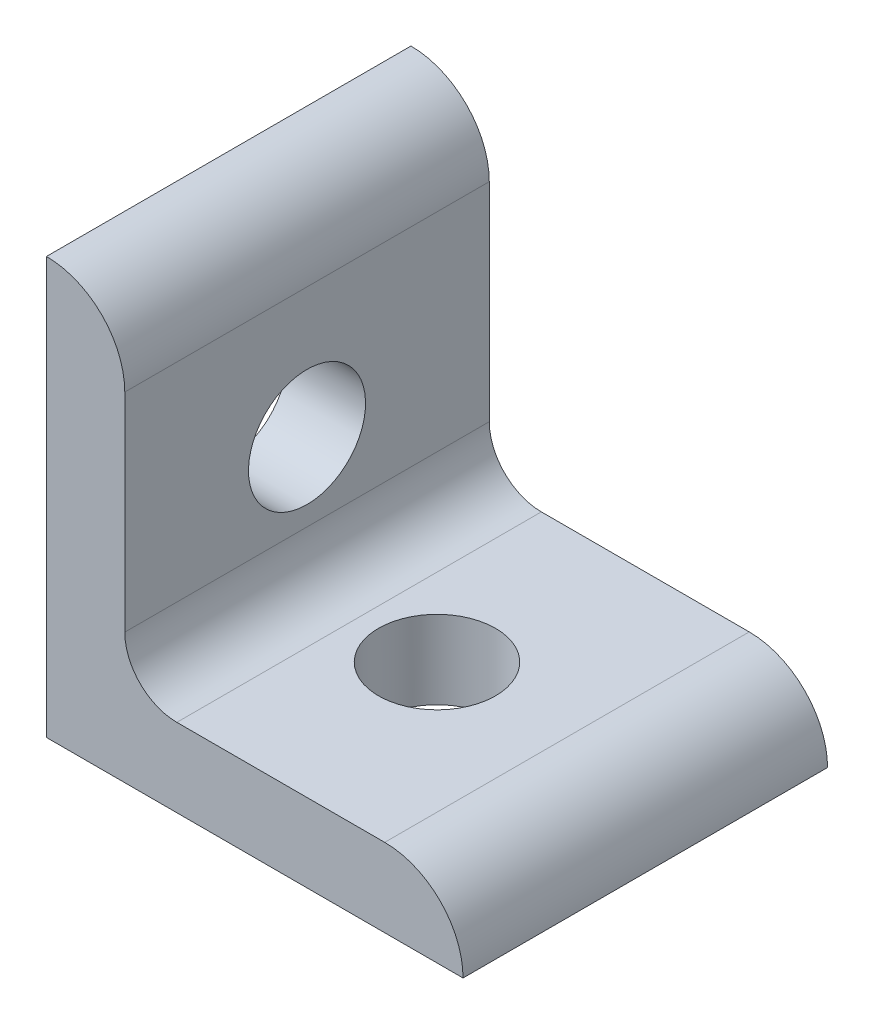
ISO-10303-21;
HEADER;
FILE_DESCRIPTION(('STEP AP214'),'2;1');
FILE_NAME('part.step','',(''),(''),'','','');
FILE_SCHEMA(('AUTOMOTIVE_DESIGN { 1 0 10303 214 1 1 1 1 }'));
ENDSEC;
DATA;
#1=APPLICATION_CONTEXT('core data for automotive mechanical design processes');
#2=APPLICATION_PROTOCOL_DEFINITION('international standard','automotive_design',2000,#1);
#3=PRODUCT_CONTEXT('',#1,'mechanical');
#4=PRODUCT('Part','Part','',(#3));
#5=PRODUCT_RELATED_PRODUCT_CATEGORY('part','',(#4));
#6=PRODUCT_DEFINITION_FORMATION('','',#4);
#7=PRODUCT_DEFINITION_CONTEXT('part definition',#1,'design');
#8=PRODUCT_DEFINITION('design','',#6,#7);
#9=PRODUCT_DEFINITION_SHAPE('','',#8);
#10=(LENGTH_UNIT() NAMED_UNIT(*) SI_UNIT(.MILLI.,.METRE.));
#11=(NAMED_UNIT(*) PLANE_ANGLE_UNIT() SI_UNIT($,.RADIAN.));
#12=(NAMED_UNIT(*) SI_UNIT($,.STERADIAN.) SOLID_ANGLE_UNIT());
#13=UNCERTAINTY_MEASURE_WITH_UNIT(LENGTH_MEASURE(1.E-05),#10,'distance_accuracy_value','');
#14=(GEOMETRIC_REPRESENTATION_CONTEXT(3) GLOBAL_UNCERTAINTY_ASSIGNED_CONTEXT((#13)) GLOBAL_UNIT_ASSIGNED_CONTEXT((#10,
#11,#12)) REPRESENTATION_CONTEXT('',''));
#15=CARTESIAN_POINT('',(0.,0.,0.));
#16=DIRECTION('',(0.,0.,1.));
#17=DIRECTION('',(1.,0.,0.));
#18=AXIS2_PLACEMENT_3D('',#15,#16,#17);
#19=CARTESIAN_POINT('',(4.7752,20.6248,11.1125));
#20=DIRECTION('',(-1.,0.,0.));
#21=DIRECTION('',(0.,-1.,0.));
#22=AXIS2_PLACEMENT_3D('',#19,#20,#21);
#23=PLANE('',#22);
#24=DIRECTION('',(0.,1.,0.));
#25=VECTOR('',#24,1.);
#26=CARTESIAN_POINT('',(4.7752,20.6248,-11.1125));
#27=LINE('',#26,#25);
#28=CARTESIAN_POINT('',(4.7752,7.9502,-11.1125));
#29=VERTEX_POINT('',#28);
#30=CARTESIAN_POINT('',(4.7752,20.6248,-11.1125));
#31=VERTEX_POINT('',#30);
#32=EDGE_CURVE('E117',#29,#31,#27,.T.);
#33=ORIENTED_EDGE('',*,*,#32,.T.);
#34=DIRECTION('',(0.,0.,-1.));
#35=VECTOR('',#34,1.);
#36=CARTESIAN_POINT('',(4.7752,20.6248,11.1125));
#37=LINE('',#36,#35);
#38=CARTESIAN_POINT('',(4.7752,20.6248,11.1125));
#39=VERTEX_POINT('',#38);
#40=EDGE_CURVE('E114',#39,#31,#37,.T.);
#41=ORIENTED_EDGE('',*,*,#40,.F.);
#42=DIRECTION('',(0.,1.,0.));
#43=VECTOR('',#42,1.);
#44=CARTESIAN_POINT('',(4.7752,20.6248,11.1125));
#45=LINE('',#44,#43);
#46=CARTESIAN_POINT('',(4.7752,7.9502,11.1125));
#47=VERTEX_POINT('',#46);
#48=EDGE_CURVE('E103',#47,#39,#45,.T.);
#49=ORIENTED_EDGE('',*,*,#48,.F.);
#50=DIRECTION('',(0.,0.,-1.));
#51=VECTOR('',#50,1.);
#52=CARTESIAN_POINT('',(4.7752,7.9502,11.1125));
#53=LINE('',#52,#51);
#54=EDGE_CURVE('E118',#47,#29,#53,.T.);
#55=ORIENTED_EDGE('',*,*,#54,.T.);
#56=EDGE_LOOP('',(#33,#41,#49,#55));
#57=FACE_BOUND('',#56,.T.);
#58=CARTESIAN_POINT('',(4.7752,12.7,0.));
#59=DIRECTION('',(-1.,0.,0.));
#60=DIRECTION('',(0.,-1.,0.));
#61=AXIS2_PLACEMENT_3D('',#58,#59,#60);
#62=CIRCLE('',#61,3.5687);
#63=CARTESIAN_POINT('',(4.7752,9.1313,0.));
#64=VERTEX_POINT('',#63);
#65=EDGE_CURVE('E167',#64,#64,#62,.F.);
#66=ORIENTED_EDGE('',*,*,#65,.F.);
#67=EDGE_LOOP('',(#66));
#68=FACE_BOUND('',#67,.T.);
#69=ADVANCED_FACE('F35',(#57,#68),#23,.F.);
#70=CARTESIAN_POINT('',(0.,0.,11.1125));
#71=DIRECTION('',(1.,0.,0.));
#72=DIRECTION('',(0.,0.,-1.));
#73=AXIS2_PLACEMENT_3D('',#70,#71,#72);
#74=PLANE('',#73);
#75=DIRECTION('',(0.,-1.,0.));
#76=VECTOR('',#75,1.);
#77=CARTESIAN_POINT('',(0.,0.,-11.1125));
#78=LINE('',#77,#76);
#79=CARTESIAN_POINT('',(0.,25.4,-11.1125));
#80=VERTEX_POINT('',#79);
#81=CARTESIAN_POINT('',(0.,0.,-11.1125));
#82=VERTEX_POINT('',#81);
#83=EDGE_CURVE('E85',#80,#82,#78,.T.);
#84=ORIENTED_EDGE('',*,*,#83,.T.);
#85=DIRECTION('',(0.,0.,-1.));
#86=VECTOR('',#85,1.);
#87=CARTESIAN_POINT('',(0.,0.,11.1125));
#88=LINE('',#87,#86);
#89=CARTESIAN_POINT('',(0.,0.,11.1125));
#90=VERTEX_POINT('',#89);
#91=EDGE_CURVE('E123',#90,#82,#88,.T.);
#92=ORIENTED_EDGE('',*,*,#91,.F.);
#93=DIRECTION('',(0.,-1.,0.));
#94=VECTOR('',#93,1.);
#95=CARTESIAN_POINT('',(0.,0.,11.1125));
#96=LINE('',#95,#94);
#97=CARTESIAN_POINT('',(0.,25.4,11.1125));
#98=VERTEX_POINT('',#97);
#99=EDGE_CURVE('E53',#98,#90,#96,.T.);
#100=ORIENTED_EDGE('',*,*,#99,.F.);
#101=DIRECTION('',(0.,0.,-1.));
#102=VECTOR('',#101,1.);
#103=CARTESIAN_POINT('',(0.,25.4,11.1125));
#104=LINE('',#103,#102);
#105=EDGE_CURVE('E119',#98,#80,#104,.T.);
#106=ORIENTED_EDGE('',*,*,#105,.T.);
#107=EDGE_LOOP('',(#84,#92,#100,#106));
#108=FACE_BOUND('',#107,.T.);
#109=CARTESIAN_POINT('',(0.,12.7,0.));
#110=DIRECTION('',(1.,0.,0.));
#111=DIRECTION('',(0.,0.,-1.));
#112=AXIS2_PLACEMENT_3D('',#109,#110,#111);
#113=CIRCLE('',#112,3.5687);
#114=CARTESIAN_POINT('',(0.,12.7,-3.5687));
#115=VERTEX_POINT('',#114);
#116=EDGE_CURVE('E170',#115,#115,#113,.T.);
#117=ORIENTED_EDGE('',*,*,#116,.T.);
#118=EDGE_LOOP('',(#117));
#119=FACE_BOUND('',#118,.T.);
#120=ADVANCED_FACE('F174',(#108,#119),#74,.F.);
#121=CARTESIAN_POINT('',(25.4,0.,11.1125));
#122=DIRECTION('',(0.,1.,0.));
#123=DIRECTION('',(-1.,0.,0.));
#124=AXIS2_PLACEMENT_3D('',#121,#122,#123);
#125=PLANE('',#124);
#126=DIRECTION('',(1.,0.,0.));
#127=VECTOR('',#126,1.);
#128=CARTESIAN_POINT('',(25.4,0.,-11.1125));
#129=LINE('',#128,#127);
#130=CARTESIAN_POINT('',(25.4,0.,-11.1125));
#131=VERTEX_POINT('',#130);
#132=EDGE_CURVE('E127',#82,#131,#129,.T.);
#133=ORIENTED_EDGE('',*,*,#132,.T.);
#134=DIRECTION('',(0.,0.,-1.));
#135=VECTOR('',#134,1.);
#136=CARTESIAN_POINT('',(25.4,0.,11.1125));
#137=LINE('',#136,#135);
#138=CARTESIAN_POINT('',(25.4,0.,11.1125));
#139=VERTEX_POINT('',#138);
#140=EDGE_CURVE('E11',#139,#131,#137,.T.);
#141=ORIENTED_EDGE('',*,*,#140,.F.);
#142=DIRECTION('',(1.,0.,0.));
#143=VECTOR('',#142,1.);
#144=CARTESIAN_POINT('',(25.4,0.,11.1125));
#145=LINE('',#144,#143);
#146=EDGE_CURVE('E139',#90,#139,#145,.T.);
#147=ORIENTED_EDGE('',*,*,#146,.F.);
#148=ORIENTED_EDGE('',*,*,#91,.T.);
#149=EDGE_LOOP('',(#133,#141,#147,#148));
#150=FACE_BOUND('',#149,.T.);
#151=CARTESIAN_POINT('',(12.7,0.,0.));
#152=DIRECTION('',(0.,1.,0.));
#153=DIRECTION('',(0.,0.,1.));
#154=AXIS2_PLACEMENT_3D('',#151,#152,#153);
#155=CIRCLE('',#154,3.5687);
#156=CARTESIAN_POINT('',(12.7,0.,3.5687));
#157=VERTEX_POINT('',#156);
#158=EDGE_CURVE('E164',#157,#157,#155,.T.);
#159=ORIENTED_EDGE('',*,*,#158,.T.);
#160=EDGE_LOOP('',(#159));
#161=FACE_BOUND('',#160,.T.);
#162=ADVANCED_FACE('F37',(#150,#161),#125,.F.);
#163=CARTESIAN_POINT('',(7.9502,4.7752,11.1125));
#164=DIRECTION('',(0.,-1.,0.));
#165=DIRECTION('',(0.,0.,-1.));
#166=AXIS2_PLACEMENT_3D('',#163,#164,#165);
#167=PLANE('',#166);
#168=DIRECTION('',(-1.,0.,0.));
#169=VECTOR('',#168,1.);
#170=CARTESIAN_POINT('',(7.9502,4.7752,-11.1125));
#171=LINE('',#170,#169);
#172=CARTESIAN_POINT('',(20.6248,4.7752,-11.1125));
#173=VERTEX_POINT('',#172);
#174=CARTESIAN_POINT('',(7.9502,4.7752,-11.1125));
#175=VERTEX_POINT('',#174);
#176=EDGE_CURVE('E132',#173,#175,#171,.T.);
#177=ORIENTED_EDGE('',*,*,#176,.T.);
#178=DIRECTION('',(0.,0.,-1.));
#179=VECTOR('',#178,1.);
#180=CARTESIAN_POINT('',(7.9502,4.7752,11.1125));
#181=LINE('',#180,#179);
#182=CARTESIAN_POINT('',(7.9502,4.7752,11.1125));
#183=VERTEX_POINT('',#182);
#184=EDGE_CURVE('E143',#183,#175,#181,.T.);
#185=ORIENTED_EDGE('',*,*,#184,.F.);
#186=DIRECTION('',(-1.,0.,0.));
#187=VECTOR('',#186,1.);
#188=CARTESIAN_POINT('',(7.9502,4.7752,11.1125));
#189=LINE('',#188,#187);
#190=CARTESIAN_POINT('',(20.6248,4.7752,11.1125));
#191=VERTEX_POINT('',#190);
#192=EDGE_CURVE('E153',#191,#183,#189,.T.);
#193=ORIENTED_EDGE('',*,*,#192,.F.);
#194=DIRECTION('',(0.,0.,-1.));
#195=VECTOR('',#194,1.);
#196=CARTESIAN_POINT('',(20.6248,4.7752,11.1125));
#197=LINE('',#196,#195);
#198=EDGE_CURVE('E45',#191,#173,#197,.T.);
#199=ORIENTED_EDGE('',*,*,#198,.T.);
#200=EDGE_LOOP('',(#177,#185,#193,#199));
#201=FACE_BOUND('',#200,.T.);
#202=CARTESIAN_POINT('',(12.7,4.7752,0.));
#203=DIRECTION('',(0.,-1.,0.));
#204=DIRECTION('',(0.,0.,-1.));
#205=AXIS2_PLACEMENT_3D('',#202,#203,#204);
#206=CIRCLE('',#205,3.5687);
#207=CARTESIAN_POINT('',(12.7,4.7752,-3.5687));
#208=VERTEX_POINT('',#207);
#209=EDGE_CURVE('E39',#208,#208,#206,.F.);
#210=ORIENTED_EDGE('',*,*,#209,.F.);
#211=EDGE_LOOP('',(#210));
#212=FACE_BOUND('',#211,.T.);
#213=ADVANCED_FACE('F150',(#201,#212),#167,.F.);
#214=CARTESIAN_POINT('',(20.6248,0.,11.1125));
#215=DIRECTION('',(0.,0.,-1.));
#216=DIRECTION('',(-1.,0.,0.));
#217=AXIS2_PLACEMENT_3D('',#214,#215,#216);
#218=CYLINDRICAL_SURFACE('',#217,4.7752);
#219=CARTESIAN_POINT('',(20.6248,0.,-11.1125));
#220=DIRECTION('',(0.,0.,1.));
#221=DIRECTION('',(1.,0.,0.));
#222=AXIS2_PLACEMENT_3D('',#219,#220,#221);
#223=CIRCLE('',#222,4.7752);
#224=EDGE_CURVE('E130',#131,#173,#223,.T.);
#225=ORIENTED_EDGE('',*,*,#224,.T.);
#226=ORIENTED_EDGE('',*,*,#198,.F.);
#227=CARTESIAN_POINT('',(20.6248,0.,11.1125));
#228=DIRECTION('',(0.,0.,1.));
#229=DIRECTION('',(1.,0.,0.));
#230=AXIS2_PLACEMENT_3D('',#227,#228,#229);
#231=CIRCLE('',#230,4.7752);
#232=EDGE_CURVE('E93',#139,#191,#231,.T.);
#233=ORIENTED_EDGE('',*,*,#232,.F.);
#234=ORIENTED_EDGE('',*,*,#140,.T.);
#235=EDGE_LOOP('',(#225,#226,#233,#234));
#236=FACE_BOUND('',#235,.T.);
#237=ADVANCED_FACE('F192',(#236),#218,.T.);
#238=CARTESIAN_POINT('',(7.9502,7.9502,11.1125));
#239=DIRECTION('',(0.,0.,-1.));
#240=DIRECTION('',(-1.,0.,0.));
#241=AXIS2_PLACEMENT_3D('',#238,#239,#240);
#242=CYLINDRICAL_SURFACE('',#241,3.175);
#243=CARTESIAN_POINT('',(7.9502,7.9502,-11.1125));
#244=DIRECTION('',(0.,0.,-1.));
#245=DIRECTION('',(1.,0.,0.));
#246=AXIS2_PLACEMENT_3D('',#243,#244,#245);
#247=CIRCLE('',#246,3.175);
#248=EDGE_CURVE('E134',#175,#29,#247,.T.);
#249=ORIENTED_EDGE('',*,*,#248,.T.);
#250=ORIENTED_EDGE('',*,*,#54,.F.);
#251=CARTESIAN_POINT('',(7.9502,7.9502,11.1125));
#252=DIRECTION('',(0.,0.,-1.));
#253=DIRECTION('',(1.,0.,0.));
#254=AXIS2_PLACEMENT_3D('',#251,#252,#253);
#255=CIRCLE('',#254,3.175);
#256=EDGE_CURVE('E109',#183,#47,#255,.T.);
#257=ORIENTED_EDGE('',*,*,#256,.F.);
#258=ORIENTED_EDGE('',*,*,#184,.T.);
#259=EDGE_LOOP('',(#249,#250,#257,#258));
#260=FACE_BOUND('',#259,.T.);
#261=ADVANCED_FACE('F159',(#260),#242,.F.);
#262=CARTESIAN_POINT('',(0.,20.6248,11.1125));
#263=DIRECTION('',(0.,0.,-1.));
#264=DIRECTION('',(-1.,0.,0.));
#265=AXIS2_PLACEMENT_3D('',#262,#263,#264);
#266=CYLINDRICAL_SURFACE('',#265,4.7752);
#267=CARTESIAN_POINT('',(0.,20.6248,-11.1125));
#268=DIRECTION('',(0.,0.,1.));
#269=DIRECTION('',(1.,0.,0.));
#270=AXIS2_PLACEMENT_3D('',#267,#268,#269);
#271=CIRCLE('',#270,4.7752);
#272=EDGE_CURVE('E79',#31,#80,#271,.T.);
#273=ORIENTED_EDGE('',*,*,#272,.T.);
#274=ORIENTED_EDGE('',*,*,#105,.F.);
#275=CARTESIAN_POINT('',(0.,20.6248,11.1125));
#276=DIRECTION('',(0.,0.,1.));
#277=DIRECTION('',(1.,0.,0.));
#278=AXIS2_PLACEMENT_3D('',#275,#276,#277);
#279=CIRCLE('',#278,4.7752);
#280=EDGE_CURVE('E107',#39,#98,#279,.T.);
#281=ORIENTED_EDGE('',*,*,#280,.F.);
#282=ORIENTED_EDGE('',*,*,#40,.T.);
#283=EDGE_LOOP('',(#273,#274,#281,#282));
#284=FACE_BOUND('',#283,.T.);
#285=ADVANCED_FACE('F121',(#284),#266,.T.);
#286=CARTESIAN_POINT('',(0.,20.6248,11.1125));
#287=DIRECTION('',(0.,0.,1.));
#288=DIRECTION('',(1.,0.,0.));
#289=AXIS2_PLACEMENT_3D('',#286,#287,#288);
#290=PLANE('',#289);
#291=ORIENTED_EDGE('',*,*,#146,.T.);
#292=ORIENTED_EDGE('',*,*,#232,.T.);
#293=ORIENTED_EDGE('',*,*,#192,.T.);
#294=ORIENTED_EDGE('',*,*,#256,.T.);
#295=ORIENTED_EDGE('',*,*,#48,.T.);
#296=ORIENTED_EDGE('',*,*,#280,.T.);
#297=ORIENTED_EDGE('',*,*,#99,.T.);
#298=EDGE_LOOP('',(#291,#292,#293,#294,#295,#296,#297));
#299=FACE_BOUND('',#298,.T.);
#300=ADVANCED_FACE('F105',(#299),#290,.T.);
#301=CARTESIAN_POINT('',(0.,20.6248,-11.1125));
#302=DIRECTION('',(0.,0.,1.));
#303=DIRECTION('',(1.,0.,0.));
#304=AXIS2_PLACEMENT_3D('',#301,#302,#303);
#305=PLANE('',#304);
#306=ORIENTED_EDGE('',*,*,#132,.F.);
#307=ORIENTED_EDGE('',*,*,#83,.F.);
#308=ORIENTED_EDGE('',*,*,#272,.F.);
#309=ORIENTED_EDGE('',*,*,#32,.F.);
#310=ORIENTED_EDGE('',*,*,#248,.F.);
#311=ORIENTED_EDGE('',*,*,#176,.F.);
#312=ORIENTED_EDGE('',*,*,#224,.F.);
#313=EDGE_LOOP('',(#306,#307,#308,#309,#310,#311,#312));
#314=FACE_BOUND('',#313,.T.);
#315=ADVANCED_FACE('F157',(#314),#305,.F.);
#316=CARTESIAN_POINT('',(12.7,25.4,0.));
#317=DIRECTION('',(0.,-1.,0.));
#318=DIRECTION('',(0.,0.,-1.));
#319=AXIS2_PLACEMENT_3D('',#316,#317,#318);
#320=CYLINDRICAL_SURFACE('',#319,3.5687);
#321=ORIENTED_EDGE('',*,*,#158,.F.);
#322=EDGE_LOOP('',(#321));
#323=FACE_BOUND('',#322,.T.);
#324=ORIENTED_EDGE('',*,*,#209,.T.);
#325=EDGE_LOOP('',(#324));
#326=FACE_BOUND('',#325,.T.);
#327=ADVANCED_FACE('F179',(#323,#326),#320,.F.);
#328=CARTESIAN_POINT('',(25.4,12.7,0.));
#329=DIRECTION('',(-1.,0.,0.));
#330=DIRECTION('',(0.,0.,1.));
#331=AXIS2_PLACEMENT_3D('',#328,#329,#330);
#332=CYLINDRICAL_SURFACE('',#331,3.5687);
#333=ORIENTED_EDGE('',*,*,#116,.F.);
#334=EDGE_LOOP('',(#333));
#335=FACE_BOUND('',#334,.T.);
#336=ORIENTED_EDGE('',*,*,#65,.T.);
#337=EDGE_LOOP('',(#336));
#338=FACE_BOUND('',#337,.T.);
#339=ADVANCED_FACE('F176',(#335,#338),#332,.F.);
#340=CLOSED_SHELL('',(#69,#120,#162,#213,#237,#261,#285,#300,#315,#327,#339));
#341=MANIFOLD_SOLID_BREP('B2',#340);
#342=ADVANCED_BREP_SHAPE_REPRESENTATION('',(#18,#341),#14);
#343=SHAPE_DEFINITION_REPRESENTATION(#9,#342);
ENDSEC;
END-ISO-10303-21;
